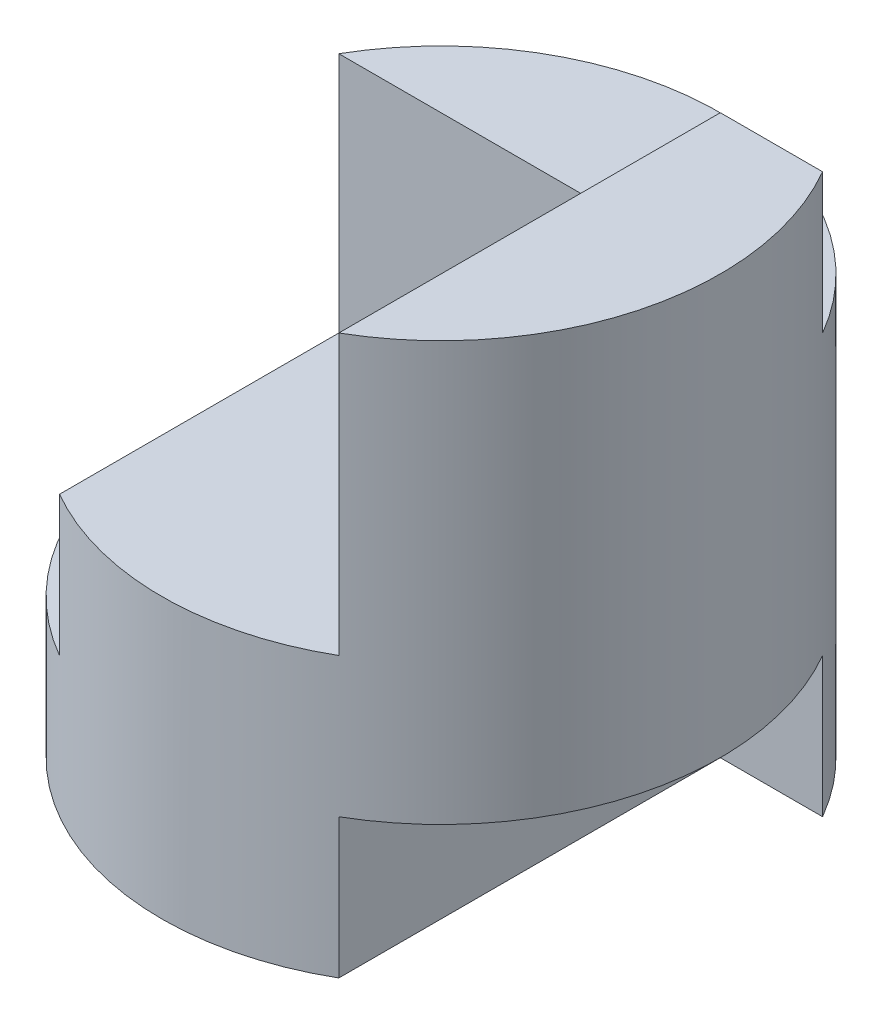
ISO-10303-21;
HEADER;
FILE_DESCRIPTION(('STEP AP214'),'2;1');
FILE_NAME('part.step','',(''),(''),'','','');
FILE_SCHEMA(('AUTOMOTIVE_DESIGN { 1 0 10303 214 1 1 1 1 }'));
ENDSEC;
DATA;
#1=APPLICATION_CONTEXT('core data for automotive mechanical design processes');
#2=APPLICATION_PROTOCOL_DEFINITION('international standard','automotive_design',2000,#1);
#3=PRODUCT_CONTEXT('',#1,'mechanical');
#4=PRODUCT('Part','Part','',(#3));
#5=PRODUCT_RELATED_PRODUCT_CATEGORY('part','',(#4));
#6=PRODUCT_DEFINITION_FORMATION('','',#4);
#7=PRODUCT_DEFINITION_CONTEXT('part definition',#1,'design');
#8=PRODUCT_DEFINITION('design','',#6,#7);
#9=PRODUCT_DEFINITION_SHAPE('','',#8);
#10=(LENGTH_UNIT() NAMED_UNIT(*) SI_UNIT(.MILLI.,.METRE.));
#11=(NAMED_UNIT(*) PLANE_ANGLE_UNIT() SI_UNIT($,.RADIAN.));
#12=(NAMED_UNIT(*) SI_UNIT($,.STERADIAN.) SOLID_ANGLE_UNIT());
#13=UNCERTAINTY_MEASURE_WITH_UNIT(LENGTH_MEASURE(1.E-05),#10,'distance_accuracy_value','');
#14=(GEOMETRIC_REPRESENTATION_CONTEXT(3) GLOBAL_UNCERTAINTY_ASSIGNED_CONTEXT((#13)) GLOBAL_UNIT_ASSIGNED_CONTEXT((#10,
#11,#12)) REPRESENTATION_CONTEXT('',''));
#15=CARTESIAN_POINT('',(0.,0.,0.));
#16=DIRECTION('',(0.,0.,1.));
#17=DIRECTION('',(1.,0.,0.));
#18=AXIS2_PLACEMENT_3D('',#15,#16,#17);
#19=CARTESIAN_POINT('',(0.,4.,0.));
#20=DIRECTION('',(0.,-1.,0.));
#21=DIRECTION('',(0.,0.,-1.));
#22=AXIS2_PLACEMENT_3D('',#19,#20,#21);
#23=CYLINDRICAL_SURFACE('',#22,2.);
#24=CARTESIAN_POINT('',(0.,3.,0.));
#25=DIRECTION('',(0.,1.,0.));
#26=DIRECTION('',(0.,0.,-1.));
#27=AXIS2_PLACEMENT_3D('',#24,#25,#26);
#28=CIRCLE('',#27,2.);
#29=CARTESIAN_POINT('',(1.73205080756888,3.,-1.));
#30=VERTEX_POINT('',#29);
#31=CARTESIAN_POINT('',(-1.73205080756888,3.,-1.));
#32=VERTEX_POINT('',#31);
#33=EDGE_CURVE('E47',#30,#32,#28,.T.);
#34=ORIENTED_EDGE('',*,*,#33,.F.);
#35=DIRECTION('',(0.,1.,0.));
#36=VECTOR('',#35,1.);
#37=CARTESIAN_POINT('',(1.73205080756888,3.,-1.));
#38=LINE('',#37,#36);
#39=CARTESIAN_POINT('',(1.73205080756888,4.,-1.));
#40=VERTEX_POINT('',#39);
#41=EDGE_CURVE('E112',#30,#40,#38,.T.);
#42=ORIENTED_EDGE('',*,*,#41,.T.);
#43=CARTESIAN_POINT('',(0.,4.,0.));
#44=DIRECTION('',(0.,1.,0.));
#45=DIRECTION('',(0.,0.,1.));
#46=AXIS2_PLACEMENT_3D('',#43,#44,#45);
#47=CIRCLE('',#46,2.);
#48=CARTESIAN_POINT('',(1.,4.,1.73205080756888));
#49=VERTEX_POINT('',#48);
#50=EDGE_CURVE('E161',#49,#40,#47,.T.);
#51=ORIENTED_EDGE('',*,*,#50,.F.);
#52=DIRECTION('',(0.,-1.,0.));
#53=VECTOR('',#52,1.);
#54=CARTESIAN_POINT('',(1.,4.,1.73205080756888));
#55=LINE('',#54,#53);
#56=CARTESIAN_POINT('',(1.,2.,1.73205080756888));
#57=VERTEX_POINT('',#56);
#58=EDGE_CURVE('E158',#57,#49,#55,.F.);
#59=ORIENTED_EDGE('',*,*,#58,.F.);
#60=CARTESIAN_POINT('',(0.,2.,0.));
#61=DIRECTION('',(0.,-1.,0.));
#62=DIRECTION('',(1.,0.,0.));
#63=AXIS2_PLACEMENT_3D('',#60,#61,#62);
#64=CIRCLE('',#63,2.);
#65=CARTESIAN_POINT('',(-1.,2.,1.73205080756888));
#66=VERTEX_POINT('',#65);
#67=EDGE_CURVE('E172',#57,#66,#64,.T.);
#68=ORIENTED_EDGE('',*,*,#67,.T.);
#69=DIRECTION('',(0.,-1.,0.));
#70=VECTOR('',#69,1.);
#71=CARTESIAN_POINT('',(-1.,4.,1.73205080756888));
#72=LINE('',#71,#70);
#73=CARTESIAN_POINT('',(-1.,1.,1.73205080756888));
#74=VERTEX_POINT('',#73);
#75=EDGE_CURVE('E40',#74,#66,#72,.F.);
#76=ORIENTED_EDGE('',*,*,#75,.F.);
#77=CARTESIAN_POINT('',(0.,1.,0.));
#78=DIRECTION('',(0.,1.,0.));
#79=DIRECTION('',(0.,0.,1.));
#80=AXIS2_PLACEMENT_3D('',#77,#78,#79);
#81=CIRCLE('',#80,2.);
#82=CARTESIAN_POINT('',(-1.73205080756888,1.,-1.));
#83=VERTEX_POINT('',#82);
#84=EDGE_CURVE('E170',#83,#74,#81,.T.);
#85=ORIENTED_EDGE('',*,*,#84,.F.);
#86=DIRECTION('',(0.,-1.,0.));
#87=VECTOR('',#86,1.);
#88=CARTESIAN_POINT('',(-1.73205080756888,4.,-1.));
#89=LINE('',#88,#87);
#90=EDGE_CURVE('E124',#32,#83,#89,.T.);
#91=ORIENTED_EDGE('',*,*,#90,.F.);
#92=EDGE_LOOP('',(#34,#42,#51,#59,#68,#76,#85,#91));
#93=FACE_BOUND('',#92,.T.);
#94=DIRECTION('',(0.,-1.,0.));
#95=VECTOR('',#94,1.);
#96=CARTESIAN_POINT('',(1.,4.,1.73205080756888));
#97=LINE('',#96,#95);
#98=CARTESIAN_POINT('',(1.,1.,1.73205080756888));
#99=VERTEX_POINT('',#98);
#100=CARTESIAN_POINT('',(1.,0.,1.73205080756888));
#101=VERTEX_POINT('',#100);
#102=EDGE_CURVE('E155',#99,#101,#97,.T.);
#103=ORIENTED_EDGE('',*,*,#102,.F.);
#104=CARTESIAN_POINT('',(0.,1.,0.));
#105=DIRECTION('',(0.,-1.,0.));
#106=DIRECTION('',(0.,0.,-1.));
#107=AXIS2_PLACEMENT_3D('',#104,#105,#106);
#108=CIRCLE('',#107,2.);
#109=CARTESIAN_POINT('',(1.73205080756888,1.,-1.));
#110=VERTEX_POINT('',#109);
#111=EDGE_CURVE('E11',#110,#99,#108,.T.);
#112=ORIENTED_EDGE('',*,*,#111,.F.);
#113=DIRECTION('',(0.,-1.,0.));
#114=VECTOR('',#113,1.);
#115=CARTESIAN_POINT('',(1.73205080756888,4.,-1.));
#116=LINE('',#115,#114);
#117=CARTESIAN_POINT('',(1.73205080756888,0.,-1.));
#118=VERTEX_POINT('',#117);
#119=EDGE_CURVE('E153',#118,#110,#116,.F.);
#120=ORIENTED_EDGE('',*,*,#119,.F.);
#121=CARTESIAN_POINT('',(0.,0.,0.));
#122=DIRECTION('',(0.,1.,0.));
#123=DIRECTION('',(0.,0.,1.));
#124=AXIS2_PLACEMENT_3D('',#121,#122,#123);
#125=CIRCLE('',#124,2.);
#126=EDGE_CURVE('E160',#118,#101,#125,.T.);
#127=ORIENTED_EDGE('',*,*,#126,.T.);
#128=EDGE_LOOP('',(#103,#112,#120,#127));
#129=FACE_BOUND('',#128,.T.);
#130=ADVANCED_FACE('F33',(#93,#129),#23,.T.);
#131=CARTESIAN_POINT('',(0.,4.,0.));
#132=DIRECTION('',(0.,1.,0.));
#133=DIRECTION('',(0.,0.,1.));
#134=AXIS2_PLACEMENT_3D('',#131,#132,#133);
#135=PLANE('',#134);
#136=DIRECTION('',(1.,0.,0.));
#137=VECTOR('',#136,1.);
#138=CARTESIAN_POINT('',(-1.73205080756888,4.,-1.));
#139=LINE('',#138,#137);
#140=CARTESIAN_POINT('',(1.,4.,-1.));
#141=VERTEX_POINT('',#140);
#142=EDGE_CURVE('E115',#141,#40,#139,.T.);
#143=ORIENTED_EDGE('',*,*,#142,.F.);
#144=DIRECTION('',(0.,0.,1.));
#145=VECTOR('',#144,1.);
#146=CARTESIAN_POINT('',(1.,4.,0.));
#147=LINE('',#146,#145);
#148=EDGE_CURVE('E167',#141,#49,#147,.T.);
#149=ORIENTED_EDGE('',*,*,#148,.T.);
#150=ORIENTED_EDGE('',*,*,#50,.T.);
#151=EDGE_LOOP('',(#143,#149,#150));
#152=FACE_BOUND('',#151,.T.);
#153=ADVANCED_FACE('F190',(#152),#135,.T.);
#154=CARTESIAN_POINT('',(0.,0.,0.));
#155=DIRECTION('',(0.,1.,0.));
#156=DIRECTION('',(0.,0.,1.));
#157=AXIS2_PLACEMENT_3D('',#154,#155,#156);
#158=PLANE('',#157);
#159=DIRECTION('',(0.,0.,-1.));
#160=VECTOR('',#159,1.);
#161=CARTESIAN_POINT('',(1.,0.,0.));
#162=LINE('',#161,#160);
#163=CARTESIAN_POINT('',(1.,0.,-1.));
#164=VERTEX_POINT('',#163);
#165=EDGE_CURVE('E163',#101,#164,#162,.T.);
#166=ORIENTED_EDGE('',*,*,#165,.F.);
#167=ORIENTED_EDGE('',*,*,#126,.F.);
#168=DIRECTION('',(1.,0.,0.));
#169=VECTOR('',#168,1.);
#170=CARTESIAN_POINT('',(0.,0.,-1.));
#171=LINE('',#170,#169);
#172=EDGE_CURVE('E130',#164,#118,#171,.T.);
#173=ORIENTED_EDGE('',*,*,#172,.F.);
#174=EDGE_LOOP('',(#166,#167,#173));
#175=FACE_BOUND('',#174,.T.);
#176=ADVANCED_FACE('F192',(#175),#158,.F.);
#177=CARTESIAN_POINT('',(0.,1.,3.));
#178=DIRECTION('',(0.,-1.,0.));
#179=DIRECTION('',(0.,0.,-1.));
#180=AXIS2_PLACEMENT_3D('',#177,#178,#179);
#181=PLANE('',#180);
#182=ORIENTED_EDGE('',*,*,#111,.T.);
#183=DIRECTION('',(0.,0.,-1.));
#184=VECTOR('',#183,1.);
#185=CARTESIAN_POINT('',(1.,1.,3.));
#186=LINE('',#185,#184);
#187=CARTESIAN_POINT('',(1.,1.,-1.));
#188=VERTEX_POINT('',#187);
#189=EDGE_CURVE('E132',#99,#188,#186,.T.);
#190=ORIENTED_EDGE('',*,*,#189,.T.);
#191=DIRECTION('',(-1.,0.,0.));
#192=VECTOR('',#191,1.);
#193=CARTESIAN_POINT('',(0.,1.,-1.));
#194=LINE('',#193,#192);
#195=EDGE_CURVE('E119',#110,#188,#194,.T.);
#196=ORIENTED_EDGE('',*,*,#195,.F.);
#197=EDGE_LOOP('',(#182,#190,#196));
#198=FACE_BOUND('',#197,.T.);
#199=ADVANCED_FACE('F198',(#198),#181,.T.);
#200=CARTESIAN_POINT('',(1.,0.,3.));
#201=DIRECTION('',(1.,0.,0.));
#202=DIRECTION('',(0.,0.,-1.));
#203=AXIS2_PLACEMENT_3D('',#200,#201,#202);
#204=PLANE('',#203);
#205=ORIENTED_EDGE('',*,*,#102,.T.);
#206=ORIENTED_EDGE('',*,*,#165,.T.);
#207=DIRECTION('',(0.,-1.,0.));
#208=VECTOR('',#207,1.);
#209=CARTESIAN_POINT('',(1.,0.,-1.));
#210=LINE('',#209,#208);
#211=EDGE_CURVE('E55',#188,#164,#210,.T.);
#212=ORIENTED_EDGE('',*,*,#211,.F.);
#213=ORIENTED_EDGE('',*,*,#189,.F.);
#214=EDGE_LOOP('',(#205,#206,#212,#213));
#215=FACE_BOUND('',#214,.T.);
#216=ADVANCED_FACE('F218',(#215),#204,.T.);
#217=CARTESIAN_POINT('',(0.,0.,-1.));
#218=DIRECTION('',(0.,0.,1.));
#219=DIRECTION('',(1.,0.,0.));
#220=AXIS2_PLACEMENT_3D('',#217,#218,#219);
#221=PLANE('',#220);
#222=ORIENTED_EDGE('',*,*,#119,.T.);
#223=ORIENTED_EDGE('',*,*,#195,.T.);
#224=ORIENTED_EDGE('',*,*,#211,.T.);
#225=ORIENTED_EDGE('',*,*,#172,.T.);
#226=EDGE_LOOP('',(#222,#223,#224,#225));
#227=FACE_BOUND('',#226,.T.);
#228=ADVANCED_FACE('F207',(#227),#221,.T.);
#229=CARTESIAN_POINT('',(0.,1.,3.));
#230=DIRECTION('',(0.,1.,0.));
#231=DIRECTION('',(0.,0.,1.));
#232=AXIS2_PLACEMENT_3D('',#229,#230,#231);
#233=PLANE('',#232);
#234=ORIENTED_EDGE('',*,*,#84,.T.);
#235=DIRECTION('',(0.,0.,-1.));
#236=VECTOR('',#235,1.);
#237=CARTESIAN_POINT('',(-1.,1.,3.));
#238=LINE('',#237,#236);
#239=CARTESIAN_POINT('',(-1.,1.,-1.));
#240=VERTEX_POINT('',#239);
#241=EDGE_CURVE('E151',#74,#240,#238,.T.);
#242=ORIENTED_EDGE('',*,*,#241,.T.);
#243=DIRECTION('',(1.,0.,0.));
#244=VECTOR('',#243,1.);
#245=CARTESIAN_POINT('',(0.,1.,-1.));
#246=LINE('',#245,#244);
#247=EDGE_CURVE('E138',#83,#240,#246,.T.);
#248=ORIENTED_EDGE('',*,*,#247,.F.);
#249=EDGE_LOOP('',(#234,#242,#248));
#250=FACE_BOUND('',#249,.T.);
#251=ADVANCED_FACE('F204',(#250),#233,.T.);
#252=CARTESIAN_POINT('',(-1.,0.,3.));
#253=DIRECTION('',(-1.,0.,0.));
#254=DIRECTION('',(0.,0.,1.));
#255=AXIS2_PLACEMENT_3D('',#252,#253,#254);
#256=PLANE('',#255);
#257=ORIENTED_EDGE('',*,*,#75,.T.);
#258=DIRECTION('',(0.,0.,-1.));
#259=VECTOR('',#258,1.);
#260=CARTESIAN_POINT('',(-1.,2.,3.));
#261=LINE('',#260,#259);
#262=CARTESIAN_POINT('',(-1.,2.,-1.));
#263=VERTEX_POINT('',#262);
#264=EDGE_CURVE('E149',#66,#263,#261,.T.);
#265=ORIENTED_EDGE('',*,*,#264,.T.);
#266=DIRECTION('',(0.,1.,0.));
#267=VECTOR('',#266,1.);
#268=CARTESIAN_POINT('',(-1.,0.,-1.));
#269=LINE('',#268,#267);
#270=EDGE_CURVE('E141',#240,#263,#269,.T.);
#271=ORIENTED_EDGE('',*,*,#270,.F.);
#272=ORIENTED_EDGE('',*,*,#241,.F.);
#273=EDGE_LOOP('',(#257,#265,#271,#272));
#274=FACE_BOUND('',#273,.T.);
#275=ADVANCED_FACE('F178',(#274),#256,.T.);
#276=CARTESIAN_POINT('',(0.,2.,3.));
#277=DIRECTION('',(0.,-1.,0.));
#278=DIRECTION('',(1.,0.,0.));
#279=AXIS2_PLACEMENT_3D('',#276,#277,#278);
#280=PLANE('',#279);
#281=DIRECTION('',(0.,0.,-1.));
#282=VECTOR('',#281,1.);
#283=CARTESIAN_POINT('',(1.,2.,3.));
#284=LINE('',#283,#282);
#285=CARTESIAN_POINT('',(1.,2.,-1.));
#286=VERTEX_POINT('',#285);
#287=EDGE_CURVE('E147',#57,#286,#284,.T.);
#288=ORIENTED_EDGE('',*,*,#287,.T.);
#289=DIRECTION('',(-1.,0.,0.));
#290=VECTOR('',#289,1.);
#291=CARTESIAN_POINT('',(0.,2.,-1.));
#292=LINE('',#291,#290);
#293=EDGE_CURVE('E144',#286,#263,#292,.T.);
#294=ORIENTED_EDGE('',*,*,#293,.T.);
#295=ORIENTED_EDGE('',*,*,#264,.F.);
#296=ORIENTED_EDGE('',*,*,#67,.F.);
#297=EDGE_LOOP('',(#288,#294,#295,#296));
#298=FACE_BOUND('',#297,.T.);
#299=ADVANCED_FACE('F181',(#298),#280,.F.);
#300=CARTESIAN_POINT('',(1.,0.,3.));
#301=DIRECTION('',(-1.,0.,0.));
#302=DIRECTION('',(0.,0.,1.));
#303=AXIS2_PLACEMENT_3D('',#300,#301,#302);
#304=PLANE('',#303);
#305=ORIENTED_EDGE('',*,*,#58,.T.);
#306=ORIENTED_EDGE('',*,*,#148,.F.);
#307=DIRECTION('',(0.,1.,0.));
#308=VECTOR('',#307,1.);
#309=CARTESIAN_POINT('',(1.,0.,-1.));
#310=LINE('',#309,#308);
#311=CARTESIAN_POINT('',(1.,3.,-1.));
#312=VERTEX_POINT('',#311);
#313=EDGE_CURVE('E134',#312,#141,#310,.T.);
#314=ORIENTED_EDGE('',*,*,#313,.F.);
#315=EDGE_CURVE('E135',#286,#312,#310,.T.);
#316=ORIENTED_EDGE('',*,*,#315,.F.);
#317=ORIENTED_EDGE('',*,*,#287,.F.);
#318=EDGE_LOOP('',(#305,#306,#314,#316,#317));
#319=FACE_BOUND('',#318,.T.);
#320=ADVANCED_FACE('F187',(#319),#304,.T.);
#321=CARTESIAN_POINT('',(0.,0.,-1.));
#322=DIRECTION('',(0.,0.,1.));
#323=DIRECTION('',(1.,0.,0.));
#324=AXIS2_PLACEMENT_3D('',#321,#322,#323);
#325=PLANE('',#324);
#326=DIRECTION('',(1.,0.,0.));
#327=VECTOR('',#326,1.);
#328=CARTESIAN_POINT('',(-1.73205080756888,3.,-1.));
#329=LINE('',#328,#327);
#330=EDGE_CURVE('E107',#32,#312,#329,.T.);
#331=ORIENTED_EDGE('',*,*,#330,.F.);
#332=ORIENTED_EDGE('',*,*,#90,.T.);
#333=ORIENTED_EDGE('',*,*,#247,.T.);
#334=ORIENTED_EDGE('',*,*,#270,.T.);
#335=ORIENTED_EDGE('',*,*,#293,.F.);
#336=ORIENTED_EDGE('',*,*,#315,.T.);
#337=EDGE_LOOP('',(#331,#332,#333,#334,#335,#336));
#338=FACE_BOUND('',#337,.T.);
#339=ADVANCED_FACE('F203',(#338),#325,.T.);
#340=CARTESIAN_POINT('',(-1.73205080756888,3.,-1.));
#341=DIRECTION('',(0.,0.,1.));
#342=DIRECTION('',(1.,0.,0.));
#343=AXIS2_PLACEMENT_3D('',#340,#341,#342);
#344=PLANE('',#343);
#345=ORIENTED_EDGE('',*,*,#313,.T.);
#346=ORIENTED_EDGE('',*,*,#142,.T.);
#347=ORIENTED_EDGE('',*,*,#41,.F.);
#348=EDGE_CURVE('E104',#312,#30,#329,.T.);
#349=ORIENTED_EDGE('',*,*,#348,.F.);
#350=EDGE_LOOP('',(#345,#346,#347,#349));
#351=FACE_BOUND('',#350,.T.);
#352=ADVANCED_FACE('F113',(#351),#344,.F.);
#353=CARTESIAN_POINT('',(0.,3.,0.));
#354=DIRECTION('',(0.,-1.,0.));
#355=DIRECTION('',(0.,0.,-1.));
#356=AXIS2_PLACEMENT_3D('',#353,#354,#355);
#357=PLANE('',#356);
#358=ORIENTED_EDGE('',*,*,#33,.T.);
#359=ORIENTED_EDGE('',*,*,#330,.T.);
#360=ORIENTED_EDGE('',*,*,#348,.T.);
#361=EDGE_LOOP('',(#358,#359,#360));
#362=FACE_BOUND('',#361,.T.);
#363=ADVANCED_FACE('F106',(#362),#357,.F.);
#364=CLOSED_SHELL('',(#130,#153,#176,#199,#216,#228,#251,#275,#299,#320,#339,#352,#363));
#365=MANIFOLD_SOLID_BREP('B2',#364);
#366=ADVANCED_BREP_SHAPE_REPRESENTATION('',(#18,#365),#14);
#367=SHAPE_DEFINITION_REPRESENTATION(#9,#366);
ENDSEC;
END-ISO-10303-21;
